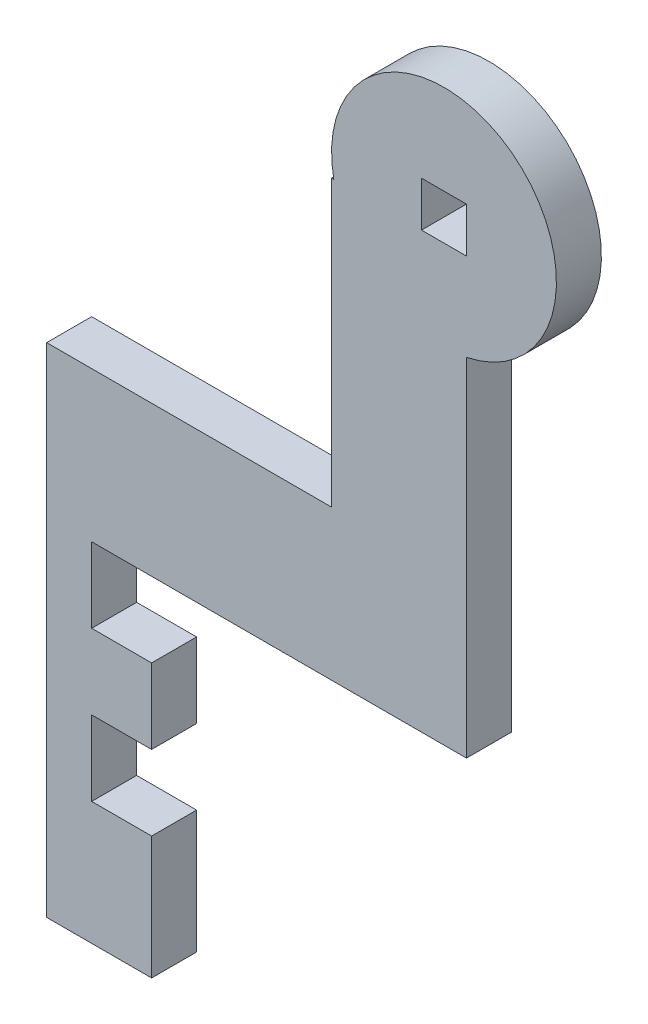
ISO-10303-21;
HEADER;
FILE_DESCRIPTION(('STEP AP214'),'2;1');
FILE_NAME('part.step','',(''),(''),'','','');
FILE_SCHEMA(('AUTOMOTIVE_DESIGN { 1 0 10303 214 1 1 1 1 }'));
ENDSEC;
DATA;
#1=APPLICATION_CONTEXT('core data for automotive mechanical design processes');
#2=APPLICATION_PROTOCOL_DEFINITION('international standard','automotive_design',2000,#1);
#3=PRODUCT_CONTEXT('',#1,'mechanical');
#4=PRODUCT('Part','Part','',(#3));
#5=PRODUCT_RELATED_PRODUCT_CATEGORY('part','',(#4));
#6=PRODUCT_DEFINITION_FORMATION('','',#4);
#7=PRODUCT_DEFINITION_CONTEXT('part definition',#1,'design');
#8=PRODUCT_DEFINITION('design','',#6,#7);
#9=PRODUCT_DEFINITION_SHAPE('','',#8);
#10=(LENGTH_UNIT() NAMED_UNIT(*) SI_UNIT(.MILLI.,.METRE.));
#11=(NAMED_UNIT(*) PLANE_ANGLE_UNIT() SI_UNIT($,.RADIAN.));
#12=(NAMED_UNIT(*) SI_UNIT($,.STERADIAN.) SOLID_ANGLE_UNIT());
#13=UNCERTAINTY_MEASURE_WITH_UNIT(LENGTH_MEASURE(1.E-05),#10,'distance_accuracy_value','');
#14=(GEOMETRIC_REPRESENTATION_CONTEXT(3) GLOBAL_UNCERTAINTY_ASSIGNED_CONTEXT((#13)) GLOBAL_UNIT_ASSIGNED_CONTEXT((#10,
#11,#12)) REPRESENTATION_CONTEXT('',''));
#15=CARTESIAN_POINT('',(0.,0.,0.));
#16=DIRECTION('',(0.,0.,1.));
#17=DIRECTION('',(1.,0.,0.));
#18=AXIS2_PLACEMENT_3D('',#15,#16,#17);
#19=CARTESIAN_POINT('',(-14.,16.6,3.));
#20=DIRECTION('',(0.,-1.,0.));
#21=DIRECTION('',(0.,0.,-1.));
#22=AXIS2_PLACEMENT_3D('',#19,#20,#21);
#23=PLANE('',#22);
#24=DIRECTION('',(0.,0.,1.));
#25=VECTOR('',#24,1.);
#26=CARTESIAN_POINT('',(5.,16.6,0.));
#27=LINE('',#26,#25);
#28=CARTESIAN_POINT('',(5.,16.6,0.));
#29=VERTEX_POINT('',#28);
#30=CARTESIAN_POINT('',(5.,16.6,3.));
#31=VERTEX_POINT('',#30);
#32=EDGE_CURVE('E53',#29,#31,#27,.T.);
#33=ORIENTED_EDGE('',*,*,#32,.F.);
#34=DIRECTION('',(-1.,0.,0.));
#35=VECTOR('',#34,1.);
#36=CARTESIAN_POINT('',(-14.,16.6,0.));
#37=LINE('',#36,#35);
#38=CARTESIAN_POINT('',(-14.,16.6,0.));
#39=VERTEX_POINT('',#38);
#40=EDGE_CURVE('E246',#29,#39,#37,.T.);
#41=ORIENTED_EDGE('',*,*,#40,.T.);
#42=DIRECTION('',(0.,0.,-1.));
#43=VECTOR('',#42,1.);
#44=CARTESIAN_POINT('',(-14.,16.6,3.));
#45=LINE('',#44,#43);
#46=CARTESIAN_POINT('',(-14.,16.6,3.));
#47=VERTEX_POINT('',#46);
#48=EDGE_CURVE('E11',#47,#39,#45,.T.);
#49=ORIENTED_EDGE('',*,*,#48,.F.);
#50=DIRECTION('',(-1.,0.,0.));
#51=VECTOR('',#50,1.);
#52=CARTESIAN_POINT('',(-14.,16.6,3.));
#53=LINE('',#52,#51);
#54=EDGE_CURVE('E230',#31,#47,#53,.T.);
#55=ORIENTED_EDGE('',*,*,#54,.F.);
#56=EDGE_LOOP('',(#33,#41,#49,#55));
#57=FACE_BOUND('',#56,.T.);
#58=ADVANCED_FACE('F36',(#57),#23,.F.);
#59=CARTESIAN_POINT('',(14.,16.6,3.));
#60=DIRECTION('',(-1.,0.,0.));
#61=DIRECTION('',(0.,-1.,0.));
#62=AXIS2_PLACEMENT_3D('',#59,#60,#61);
#63=PLANE('',#62);
#64=DIRECTION('',(0.,1.,0.));
#65=VECTOR('',#64,1.);
#66=CARTESIAN_POINT('',(14.,16.6,3.));
#67=LINE('',#66,#65);
#68=CARTESIAN_POINT('',(14.,6.6,3.));
#69=VERTEX_POINT('',#68);
#70=CARTESIAN_POINT('',(14.,29.7515307716505,3.));
#71=VERTEX_POINT('',#70);
#72=EDGE_CURVE('E261',#69,#71,#67,.T.);
#73=ORIENTED_EDGE('',*,*,#72,.F.);
#74=DIRECTION('',(0.,0.,1.));
#75=VECTOR('',#74,1.);
#76=CARTESIAN_POINT('',(14.,6.6,0.));
#77=LINE('',#76,#75);
#78=CARTESIAN_POINT('',(14.,6.6,0.));
#79=VERTEX_POINT('',#78);
#80=EDGE_CURVE('E253',#79,#69,#77,.T.);
#81=ORIENTED_EDGE('',*,*,#80,.F.);
#82=DIRECTION('',(0.,1.,0.));
#83=VECTOR('',#82,1.);
#84=CARTESIAN_POINT('',(14.,16.6,0.));
#85=LINE('',#84,#83);
#86=CARTESIAN_POINT('',(14.,29.7515307716505,0.));
#87=VERTEX_POINT('',#86);
#88=EDGE_CURVE('E250',#79,#87,#85,.T.);
#89=ORIENTED_EDGE('',*,*,#88,.T.);
#90=DIRECTION('',(0.,0.,1.));
#91=VECTOR('',#90,1.);
#92=CARTESIAN_POINT('',(14.,29.7515307716505,0.));
#93=LINE('',#92,#91);
#94=EDGE_CURVE('E339',#87,#71,#93,.T.);
#95=ORIENTED_EDGE('',*,*,#94,.T.);
#96=EDGE_LOOP('',(#73,#81,#89,#95));
#97=FACE_BOUND('',#96,.T.);
#98=ADVANCED_FACE('F38',(#97),#63,.F.);
#99=CARTESIAN_POINT('',(-14.,16.6,3.));
#100=DIRECTION('',(1.,0.,0.));
#101=DIRECTION('',(0.,1.,0.));
#102=AXIS2_PLACEMENT_3D('',#99,#100,#101);
#103=PLANE('',#102);
#104=DIRECTION('',(0.,-1.,0.));
#105=VECTOR('',#104,1.);
#106=CARTESIAN_POINT('',(-14.,16.6,0.));
#107=LINE('',#106,#105);
#108=CARTESIAN_POINT('',(-14.,-16.6,0.));
#109=VERTEX_POINT('',#108);
#110=EDGE_CURVE('E248',#39,#109,#107,.T.);
#111=ORIENTED_EDGE('',*,*,#110,.T.);
#112=DIRECTION('',(0.,0.,-1.));
#113=VECTOR('',#112,1.);
#114=CARTESIAN_POINT('',(-14.,-16.6,3.));
#115=LINE('',#114,#113);
#116=CARTESIAN_POINT('',(-14.,-16.6,3.));
#117=VERTEX_POINT('',#116);
#118=EDGE_CURVE('E45',#117,#109,#115,.T.);
#119=ORIENTED_EDGE('',*,*,#118,.F.);
#120=DIRECTION('',(0.,-1.,0.));
#121=VECTOR('',#120,1.);
#122=CARTESIAN_POINT('',(-14.,16.6,3.));
#123=LINE('',#122,#121);
#124=EDGE_CURVE('E268',#47,#117,#123,.T.);
#125=ORIENTED_EDGE('',*,*,#124,.F.);
#126=ORIENTED_EDGE('',*,*,#48,.T.);
#127=EDGE_LOOP('',(#111,#119,#125,#126));
#128=FACE_BOUND('',#127,.T.);
#129=ADVANCED_FACE('F385',(#128),#103,.F.);
#130=CARTESIAN_POINT('',(-14.,-16.6,3.));
#131=DIRECTION('',(0.,1.,0.));
#132=DIRECTION('',(-1.,0.,0.));
#133=AXIS2_PLACEMENT_3D('',#130,#131,#132);
#134=PLANE('',#133);
#135=DIRECTION('',(1.,0.,0.));
#136=VECTOR('',#135,1.);
#137=CARTESIAN_POINT('',(-14.,-16.6,0.));
#138=LINE('',#137,#136);
#139=CARTESIAN_POINT('',(-7.,-16.6,0.));
#140=VERTEX_POINT('',#139);
#141=EDGE_CURVE('E251',#109,#140,#138,.T.);
#142=ORIENTED_EDGE('',*,*,#141,.T.);
#143=DIRECTION('',(0.,0.,1.));
#144=VECTOR('',#143,1.);
#145=CARTESIAN_POINT('',(-7.,-16.6,0.));
#146=LINE('',#145,#144);
#147=CARTESIAN_POINT('',(-7.,-16.6,3.));
#148=VERTEX_POINT('',#147);
#149=EDGE_CURVE('E289',#140,#148,#146,.T.);
#150=ORIENTED_EDGE('',*,*,#149,.T.);
#151=DIRECTION('',(1.,0.,0.));
#152=VECTOR('',#151,1.);
#153=CARTESIAN_POINT('',(-14.,-16.6,3.));
#154=LINE('',#153,#152);
#155=EDGE_CURVE('E263',#117,#148,#154,.T.);
#156=ORIENTED_EDGE('',*,*,#155,.F.);
#157=ORIENTED_EDGE('',*,*,#118,.T.);
#158=EDGE_LOOP('',(#142,#150,#156,#157));
#159=FACE_BOUND('',#158,.T.);
#160=ADVANCED_FACE('F383',(#159),#134,.F.);
#161=CARTESIAN_POINT('',(0.,0.,3.));
#162=DIRECTION('',(0.,0.,1.));
#163=DIRECTION('',(1.,0.,0.));
#164=AXIS2_PLACEMENT_3D('',#161,#162,#163);
#165=PLANE('',#164);
#166=DIRECTION('',(-1.,0.,0.));
#167=VECTOR('',#166,1.);
#168=CARTESIAN_POINT('',(0.,6.6,3.));
#169=LINE('',#168,#167);
#170=CARTESIAN_POINT('',(-11.,6.6,3.));
#171=VERTEX_POINT('',#170);
#172=EDGE_CURVE('E229',#69,#171,#169,.T.);
#173=ORIENTED_EDGE('',*,*,#172,.F.);
#174=ORIENTED_EDGE('',*,*,#72,.T.);
#175=CARTESIAN_POINT('',(12.5,37.1,3.));
#176=DIRECTION('',(0.,0.,1.));
#177=DIRECTION('',(1.,0.,0.));
#178=AXIS2_PLACEMENT_3D('',#175,#176,#177);
#179=CIRCLE('',#178,7.5);
#180=CARTESIAN_POINT('',(5.15153077165046,35.6,3.));
#181=VERTEX_POINT('',#180);
#182=EDGE_CURVE('E216',#71,#181,#179,.T.);
#183=ORIENTED_EDGE('',*,*,#182,.T.);
#184=DIRECTION('',(-1.,0.,0.));
#185=VECTOR('',#184,1.);
#186=CARTESIAN_POINT('',(0.,35.6,3.));
#187=LINE('',#186,#185);
#188=CARTESIAN_POINT('',(5.,35.6,3.));
#189=VERTEX_POINT('',#188);
#190=EDGE_CURVE('E219',#181,#189,#187,.T.);
#191=ORIENTED_EDGE('',*,*,#190,.T.);
#192=DIRECTION('',(0.,-1.,0.));
#193=VECTOR('',#192,1.);
#194=CARTESIAN_POINT('',(5.,0.,3.));
#195=LINE('',#194,#193);
#196=EDGE_CURVE('E190',#189,#31,#195,.T.);
#197=ORIENTED_EDGE('',*,*,#196,.T.);
#198=ORIENTED_EDGE('',*,*,#54,.T.);
#199=ORIENTED_EDGE('',*,*,#124,.T.);
#200=ORIENTED_EDGE('',*,*,#155,.T.);
#201=DIRECTION('',(0.,-1.,0.));
#202=VECTOR('',#201,1.);
#203=CARTESIAN_POINT('',(-7.,0.,3.));
#204=LINE('',#203,#202);
#205=CARTESIAN_POINT('',(-7.,-8.4,3.));
#206=VERTEX_POINT('',#205);
#207=EDGE_CURVE('E293',#206,#148,#204,.T.);
#208=ORIENTED_EDGE('',*,*,#207,.F.);
#209=DIRECTION('',(-1.,0.,0.));
#210=VECTOR('',#209,1.);
#211=CARTESIAN_POINT('',(0.,-8.4,3.));
#212=LINE('',#211,#210);
#213=CARTESIAN_POINT('',(-11.,-8.4,3.));
#214=VERTEX_POINT('',#213);
#215=EDGE_CURVE('E296',#206,#214,#212,.T.);
#216=ORIENTED_EDGE('',*,*,#215,.T.);
#217=DIRECTION('',(0.,-1.,0.));
#218=VECTOR('',#217,1.);
#219=CARTESIAN_POINT('',(-11.,0.,3.));
#220=LINE('',#219,#218);
#221=CARTESIAN_POINT('',(-11.,-3.4,3.));
#222=VERTEX_POINT('',#221);
#223=EDGE_CURVE('E299',#222,#214,#220,.T.);
#224=ORIENTED_EDGE('',*,*,#223,.F.);
#225=DIRECTION('',(-1.,0.,0.));
#226=VECTOR('',#225,1.);
#227=CARTESIAN_POINT('',(0.,-3.4,3.));
#228=LINE('',#227,#226);
#229=CARTESIAN_POINT('',(-7.,-3.4,3.));
#230=VERTEX_POINT('',#229);
#231=EDGE_CURVE('E302',#230,#222,#228,.T.);
#232=ORIENTED_EDGE('',*,*,#231,.F.);
#233=DIRECTION('',(0.,-1.,0.));
#234=VECTOR('',#233,1.);
#235=CARTESIAN_POINT('',(-7.,0.,3.));
#236=LINE('',#235,#234);
#237=CARTESIAN_POINT('',(-7.,1.6,3.));
#238=VERTEX_POINT('',#237);
#239=EDGE_CURVE('E305',#238,#230,#236,.T.);
#240=ORIENTED_EDGE('',*,*,#239,.F.);
#241=DIRECTION('',(-1.,0.,0.));
#242=VECTOR('',#241,1.);
#243=CARTESIAN_POINT('',(0.,1.6,3.));
#244=LINE('',#243,#242);
#245=CARTESIAN_POINT('',(-11.,1.6,3.));
#246=VERTEX_POINT('',#245);
#247=EDGE_CURVE('E308',#238,#246,#244,.T.);
#248=ORIENTED_EDGE('',*,*,#247,.T.);
#249=DIRECTION('',(0.,-1.,0.));
#250=VECTOR('',#249,1.);
#251=CARTESIAN_POINT('',(-11.,0.,3.));
#252=LINE('',#251,#250);
#253=EDGE_CURVE('E311',#171,#246,#252,.T.);
#254=ORIENTED_EDGE('',*,*,#253,.F.);
#255=EDGE_LOOP('',(#173,#174,#183,#191,#197,#198,#199,#200,#208,#216,#224,#232,#240,#248,#254));
#256=FACE_BOUND('',#255,.T.);
#257=DIRECTION('',(0.,1.,0.));
#258=VECTOR('',#257,1.);
#259=CARTESIAN_POINT('',(14.,0.,3.));
#260=LINE('',#259,#258);
#261=CARTESIAN_POINT('',(14.,35.6,3.));
#262=VERTEX_POINT('',#261);
#263=CARTESIAN_POINT('',(14.,38.6,3.));
#264=VERTEX_POINT('',#263);
#265=EDGE_CURVE('E207',#262,#264,#260,.T.);
#266=ORIENTED_EDGE('',*,*,#265,.F.);
#267=DIRECTION('',(-1.,0.,0.));
#268=VECTOR('',#267,1.);
#269=CARTESIAN_POINT('',(0.,35.6,3.));
#270=LINE('',#269,#268);
#271=CARTESIAN_POINT('',(11.,35.6,3.));
#272=VERTEX_POINT('',#271);
#273=EDGE_CURVE('E176',#262,#272,#270,.T.);
#274=ORIENTED_EDGE('',*,*,#273,.T.);
#275=DIRECTION('',(0.,1.,0.));
#276=VECTOR('',#275,1.);
#277=CARTESIAN_POINT('',(11.,0.,3.));
#278=LINE('',#277,#276);
#279=CARTESIAN_POINT('',(11.,38.6,3.));
#280=VERTEX_POINT('',#279);
#281=EDGE_CURVE('E210',#272,#280,#278,.T.);
#282=ORIENTED_EDGE('',*,*,#281,.T.);
#283=DIRECTION('',(-1.,0.,0.));
#284=VECTOR('',#283,1.);
#285=CARTESIAN_POINT('',(0.,38.6,3.));
#286=LINE('',#285,#284);
#287=EDGE_CURVE('E213',#264,#280,#286,.T.);
#288=ORIENTED_EDGE('',*,*,#287,.F.);
#289=EDGE_LOOP('',(#266,#274,#282,#288));
#290=FACE_BOUND('',#289,.T.);
#291=ADVANCED_FACE('F348',(#256,#290),#165,.T.);
#292=CARTESIAN_POINT('',(0.,0.,0.));
#293=DIRECTION('',(0.,0.,1.));
#294=DIRECTION('',(1.,0.,0.));
#295=AXIS2_PLACEMENT_3D('',#292,#293,#294);
#296=PLANE('',#295);
#297=ORIENTED_EDGE('',*,*,#88,.F.);
#298=DIRECTION('',(-1.,0.,0.));
#299=VECTOR('',#298,1.);
#300=CARTESIAN_POINT('',(0.,6.6,0.));
#301=LINE('',#300,#299);
#302=CARTESIAN_POINT('',(-11.,6.6,0.));
#303=VERTEX_POINT('',#302);
#304=EDGE_CURVE('E295',#79,#303,#301,.T.);
#305=ORIENTED_EDGE('',*,*,#304,.T.);
#306=DIRECTION('',(0.,-1.,0.));
#307=VECTOR('',#306,1.);
#308=CARTESIAN_POINT('',(-11.,0.,0.));
#309=LINE('',#308,#307);
#310=CARTESIAN_POINT('',(-11.,1.6,0.));
#311=VERTEX_POINT('',#310);
#312=EDGE_CURVE('E330',#303,#311,#309,.T.);
#313=ORIENTED_EDGE('',*,*,#312,.T.);
#314=DIRECTION('',(-1.,0.,0.));
#315=VECTOR('',#314,1.);
#316=CARTESIAN_POINT('',(0.,1.6,0.));
#317=LINE('',#316,#315);
#318=CARTESIAN_POINT('',(-7.,1.6,0.));
#319=VERTEX_POINT('',#318);
#320=EDGE_CURVE('E328',#319,#311,#317,.T.);
#321=ORIENTED_EDGE('',*,*,#320,.F.);
#322=DIRECTION('',(0.,-1.,0.));
#323=VECTOR('',#322,1.);
#324=CARTESIAN_POINT('',(-7.,0.,0.));
#325=LINE('',#324,#323);
#326=CARTESIAN_POINT('',(-7.,-3.4,0.));
#327=VERTEX_POINT('',#326);
#328=EDGE_CURVE('E325',#319,#327,#325,.T.);
#329=ORIENTED_EDGE('',*,*,#328,.T.);
#330=DIRECTION('',(-1.,0.,0.));
#331=VECTOR('',#330,1.);
#332=CARTESIAN_POINT('',(0.,-3.4,0.));
#333=LINE('',#332,#331);
#334=CARTESIAN_POINT('',(-11.,-3.4,0.));
#335=VERTEX_POINT('',#334);
#336=EDGE_CURVE('E322',#327,#335,#333,.T.);
#337=ORIENTED_EDGE('',*,*,#336,.T.);
#338=DIRECTION('',(0.,-1.,0.));
#339=VECTOR('',#338,1.);
#340=CARTESIAN_POINT('',(-11.,0.,0.));
#341=LINE('',#340,#339);
#342=CARTESIAN_POINT('',(-11.,-8.4,0.));
#343=VERTEX_POINT('',#342);
#344=EDGE_CURVE('E319',#335,#343,#341,.T.);
#345=ORIENTED_EDGE('',*,*,#344,.T.);
#346=DIRECTION('',(-1.,0.,0.));
#347=VECTOR('',#346,1.);
#348=CARTESIAN_POINT('',(0.,-8.4,0.));
#349=LINE('',#348,#347);
#350=CARTESIAN_POINT('',(-7.,-8.4,0.));
#351=VERTEX_POINT('',#350);
#352=EDGE_CURVE('E317',#351,#343,#349,.T.);
#353=ORIENTED_EDGE('',*,*,#352,.F.);
#354=DIRECTION('',(0.,-1.,0.));
#355=VECTOR('',#354,1.);
#356=CARTESIAN_POINT('',(-7.,0.,0.));
#357=LINE('',#356,#355);
#358=EDGE_CURVE('E277',#351,#140,#357,.T.);
#359=ORIENTED_EDGE('',*,*,#358,.T.);
#360=ORIENTED_EDGE('',*,*,#141,.F.);
#361=ORIENTED_EDGE('',*,*,#110,.F.);
#362=ORIENTED_EDGE('',*,*,#40,.F.);
#363=DIRECTION('',(0.,-1.,0.));
#364=VECTOR('',#363,1.);
#365=CARTESIAN_POINT('',(5.,0.,0.));
#366=LINE('',#365,#364);
#367=CARTESIAN_POINT('',(5.,35.6,0.));
#368=VERTEX_POINT('',#367);
#369=EDGE_CURVE('E181',#368,#29,#366,.T.);
#370=ORIENTED_EDGE('',*,*,#369,.F.);
#371=DIRECTION('',(-1.,0.,0.));
#372=VECTOR('',#371,1.);
#373=CARTESIAN_POINT('',(0.,35.6,0.));
#374=LINE('',#373,#372);
#375=CARTESIAN_POINT('',(5.15153077165046,35.6,0.));
#376=VERTEX_POINT('',#375);
#377=EDGE_CURVE('E204',#376,#368,#374,.T.);
#378=ORIENTED_EDGE('',*,*,#377,.F.);
#379=CARTESIAN_POINT('',(12.5,37.1,0.));
#380=DIRECTION('',(0.,0.,1.));
#381=DIRECTION('',(1.,0.,0.));
#382=AXIS2_PLACEMENT_3D('',#379,#380,#381);
#383=CIRCLE('',#382,7.5);
#384=EDGE_CURVE('E201',#87,#376,#383,.T.);
#385=ORIENTED_EDGE('',*,*,#384,.F.);
#386=EDGE_LOOP('',(#297,#305,#313,#321,#329,#337,#345,#353,#359,#360,#361,#362,#370,#378,#385));
#387=FACE_BOUND('',#386,.T.);
#388=DIRECTION('',(0.,1.,0.));
#389=VECTOR('',#388,1.);
#390=CARTESIAN_POINT('',(14.,0.,0.));
#391=LINE('',#390,#389);
#392=CARTESIAN_POINT('',(14.,35.6,0.));
#393=VERTEX_POINT('',#392);
#394=CARTESIAN_POINT('',(14.,38.6,0.));
#395=VERTEX_POINT('',#394);
#396=EDGE_CURVE('E185',#393,#395,#391,.T.);
#397=ORIENTED_EDGE('',*,*,#396,.T.);
#398=DIRECTION('',(-1.,0.,0.));
#399=VECTOR('',#398,1.);
#400=CARTESIAN_POINT('',(0.,38.6,0.));
#401=LINE('',#400,#399);
#402=CARTESIAN_POINT('',(11.,38.6,0.));
#403=VERTEX_POINT('',#402);
#404=EDGE_CURVE('E197',#395,#403,#401,.T.);
#405=ORIENTED_EDGE('',*,*,#404,.T.);
#406=DIRECTION('',(0.,1.,0.));
#407=VECTOR('',#406,1.);
#408=CARTESIAN_POINT('',(11.,0.,0.));
#409=LINE('',#408,#407);
#410=CARTESIAN_POINT('',(11.,35.6,0.));
#411=VERTEX_POINT('',#410);
#412=EDGE_CURVE('E195',#411,#403,#409,.T.);
#413=ORIENTED_EDGE('',*,*,#412,.F.);
#414=DIRECTION('',(-1.,0.,0.));
#415=VECTOR('',#414,1.);
#416=CARTESIAN_POINT('',(0.,35.6,0.));
#417=LINE('',#416,#415);
#418=EDGE_CURVE('E174',#393,#411,#417,.T.);
#419=ORIENTED_EDGE('',*,*,#418,.F.);
#420=EDGE_LOOP('',(#397,#405,#413,#419));
#421=FACE_BOUND('',#420,.T.);
#422=ADVANCED_FACE('F193',(#387,#421),#296,.F.);
#423=CARTESIAN_POINT('',(0.,6.6,0.));
#424=DIRECTION('',(0.,1.,0.));
#425=DIRECTION('',(0.,0.,1.));
#426=AXIS2_PLACEMENT_3D('',#423,#424,#425);
#427=PLANE('',#426);
#428=ORIENTED_EDGE('',*,*,#172,.T.);
#429=DIRECTION('',(0.,0.,1.));
#430=VECTOR('',#429,1.);
#431=CARTESIAN_POINT('',(-11.,6.6,0.));
#432=LINE('',#431,#430);
#433=EDGE_CURVE('E275',#303,#171,#432,.T.);
#434=ORIENTED_EDGE('',*,*,#433,.F.);
#435=ORIENTED_EDGE('',*,*,#304,.F.);
#436=ORIENTED_EDGE('',*,*,#80,.T.);
#437=EDGE_LOOP('',(#428,#434,#435,#436));
#438=FACE_BOUND('',#437,.T.);
#439=ADVANCED_FACE('F356',(#438),#427,.F.);
#440=CARTESIAN_POINT('',(-7.,0.,0.));
#441=DIRECTION('',(-1.,0.,0.));
#442=DIRECTION('',(0.,0.,1.));
#443=AXIS2_PLACEMENT_3D('',#440,#441,#442);
#444=PLANE('',#443);
#445=ORIENTED_EDGE('',*,*,#207,.T.);
#446=ORIENTED_EDGE('',*,*,#149,.F.);
#447=ORIENTED_EDGE('',*,*,#358,.F.);
#448=DIRECTION('',(0.,0.,1.));
#449=VECTOR('',#448,1.);
#450=CARTESIAN_POINT('',(-7.,-8.4,0.));
#451=LINE('',#450,#449);
#452=EDGE_CURVE('E287',#351,#206,#451,.T.);
#453=ORIENTED_EDGE('',*,*,#452,.T.);
#454=EDGE_LOOP('',(#445,#446,#447,#453));
#455=FACE_BOUND('',#454,.T.);
#456=ADVANCED_FACE('F382',(#455),#444,.F.);
#457=CARTESIAN_POINT('',(0.,-8.4,0.));
#458=DIRECTION('',(0.,1.,0.));
#459=DIRECTION('',(0.,0.,1.));
#460=AXIS2_PLACEMENT_3D('',#457,#458,#459);
#461=PLANE('',#460);
#462=ORIENTED_EDGE('',*,*,#215,.F.);
#463=ORIENTED_EDGE('',*,*,#452,.F.);
#464=ORIENTED_EDGE('',*,*,#352,.T.);
#465=DIRECTION('',(0.,0.,1.));
#466=VECTOR('',#465,1.);
#467=CARTESIAN_POINT('',(-11.,-8.4,0.));
#468=LINE('',#467,#466);
#469=EDGE_CURVE('E285',#343,#214,#468,.T.);
#470=ORIENTED_EDGE('',*,*,#469,.T.);
#471=EDGE_LOOP('',(#462,#463,#464,#470));
#472=FACE_BOUND('',#471,.T.);
#473=ADVANCED_FACE('F379',(#472),#461,.T.);
#474=CARTESIAN_POINT('',(-11.,0.,0.));
#475=DIRECTION('',(-1.,0.,0.));
#476=DIRECTION('',(0.,0.,1.));
#477=AXIS2_PLACEMENT_3D('',#474,#475,#476);
#478=PLANE('',#477);
#479=ORIENTED_EDGE('',*,*,#223,.T.);
#480=ORIENTED_EDGE('',*,*,#469,.F.);
#481=ORIENTED_EDGE('',*,*,#344,.F.);
#482=DIRECTION('',(0.,0.,1.));
#483=VECTOR('',#482,1.);
#484=CARTESIAN_POINT('',(-11.,-3.4,0.));
#485=LINE('',#484,#483);
#486=EDGE_CURVE('E283',#335,#222,#485,.T.);
#487=ORIENTED_EDGE('',*,*,#486,.T.);
#488=EDGE_LOOP('',(#479,#480,#481,#487));
#489=FACE_BOUND('',#488,.T.);
#490=ADVANCED_FACE('F375',(#489),#478,.F.);
#491=CARTESIAN_POINT('',(0.,-3.4,0.));
#492=DIRECTION('',(0.,1.,0.));
#493=DIRECTION('',(0.,0.,1.));
#494=AXIS2_PLACEMENT_3D('',#491,#492,#493);
#495=PLANE('',#494);
#496=ORIENTED_EDGE('',*,*,#231,.T.);
#497=ORIENTED_EDGE('',*,*,#486,.F.);
#498=ORIENTED_EDGE('',*,*,#336,.F.);
#499=DIRECTION('',(0.,0.,1.));
#500=VECTOR('',#499,1.);
#501=CARTESIAN_POINT('',(-7.,-3.4,0.));
#502=LINE('',#501,#500);
#503=EDGE_CURVE('E281',#327,#230,#502,.T.);
#504=ORIENTED_EDGE('',*,*,#503,.T.);
#505=EDGE_LOOP('',(#496,#497,#498,#504));
#506=FACE_BOUND('',#505,.T.);
#507=ADVANCED_FACE('F370',(#506),#495,.F.);
#508=CARTESIAN_POINT('',(-7.,0.,0.));
#509=DIRECTION('',(-1.,0.,0.));
#510=DIRECTION('',(0.,0.,1.));
#511=AXIS2_PLACEMENT_3D('',#508,#509,#510);
#512=PLANE('',#511);
#513=ORIENTED_EDGE('',*,*,#239,.T.);
#514=ORIENTED_EDGE('',*,*,#503,.F.);
#515=ORIENTED_EDGE('',*,*,#328,.F.);
#516=DIRECTION('',(0.,0.,1.));
#517=VECTOR('',#516,1.);
#518=CARTESIAN_POINT('',(-7.,1.6,0.));
#519=LINE('',#518,#517);
#520=EDGE_CURVE('E279',#319,#238,#519,.T.);
#521=ORIENTED_EDGE('',*,*,#520,.T.);
#522=EDGE_LOOP('',(#513,#514,#515,#521));
#523=FACE_BOUND('',#522,.T.);
#524=ADVANCED_FACE('F366',(#523),#512,.F.);
#525=CARTESIAN_POINT('',(0.,1.6,0.));
#526=DIRECTION('',(0.,1.,0.));
#527=DIRECTION('',(0.,0.,1.));
#528=AXIS2_PLACEMENT_3D('',#525,#526,#527);
#529=PLANE('',#528);
#530=ORIENTED_EDGE('',*,*,#247,.F.);
#531=ORIENTED_EDGE('',*,*,#520,.F.);
#532=ORIENTED_EDGE('',*,*,#320,.T.);
#533=DIRECTION('',(0.,0.,1.));
#534=VECTOR('',#533,1.);
#535=CARTESIAN_POINT('',(-11.,1.6,0.));
#536=LINE('',#535,#534);
#537=EDGE_CURVE('E61',#311,#246,#536,.T.);
#538=ORIENTED_EDGE('',*,*,#537,.T.);
#539=EDGE_LOOP('',(#530,#531,#532,#538));
#540=FACE_BOUND('',#539,.T.);
#541=ADVANCED_FACE('F364',(#540),#529,.T.);
#542=CARTESIAN_POINT('',(-11.,0.,0.));
#543=DIRECTION('',(-1.,0.,0.));
#544=DIRECTION('',(0.,0.,1.));
#545=AXIS2_PLACEMENT_3D('',#542,#543,#544);
#546=PLANE('',#545);
#547=ORIENTED_EDGE('',*,*,#253,.T.);
#548=ORIENTED_EDGE('',*,*,#537,.F.);
#549=ORIENTED_EDGE('',*,*,#312,.F.);
#550=ORIENTED_EDGE('',*,*,#433,.T.);
#551=EDGE_LOOP('',(#547,#548,#549,#550));
#552=FACE_BOUND('',#551,.T.);
#553=ADVANCED_FACE('F360',(#552),#546,.F.);
#554=CARTESIAN_POINT('',(5.,0.,0.));
#555=DIRECTION('',(-1.,0.,0.));
#556=DIRECTION('',(0.,0.,1.));
#557=AXIS2_PLACEMENT_3D('',#554,#555,#556);
#558=PLANE('',#557);
#559=ORIENTED_EDGE('',*,*,#196,.F.);
#560=DIRECTION('',(0.,0.,1.));
#561=VECTOR('',#560,1.);
#562=CARTESIAN_POINT('',(5.,35.6,0.));
#563=LINE('',#562,#561);
#564=EDGE_CURVE('E224',#368,#189,#563,.T.);
#565=ORIENTED_EDGE('',*,*,#564,.F.);
#566=ORIENTED_EDGE('',*,*,#369,.T.);
#567=ORIENTED_EDGE('',*,*,#32,.T.);
#568=EDGE_LOOP('',(#559,#565,#566,#567));
#569=FACE_BOUND('',#568,.T.);
#570=ADVANCED_FACE('F240',(#569),#558,.T.);
#571=CARTESIAN_POINT('',(0.,35.6,0.));
#572=DIRECTION('',(0.,1.,0.));
#573=DIRECTION('',(0.,0.,1.));
#574=AXIS2_PLACEMENT_3D('',#571,#572,#573);
#575=PLANE('',#574);
#576=ORIENTED_EDGE('',*,*,#190,.F.);
#577=DIRECTION('',(0.,0.,1.));
#578=VECTOR('',#577,1.);
#579=CARTESIAN_POINT('',(5.15153077165046,35.6,0.));
#580=LINE('',#579,#578);
#581=EDGE_CURVE('E341',#376,#181,#580,.T.);
#582=ORIENTED_EDGE('',*,*,#581,.F.);
#583=ORIENTED_EDGE('',*,*,#377,.T.);
#584=ORIENTED_EDGE('',*,*,#564,.T.);
#585=EDGE_LOOP('',(#576,#582,#583,#584));
#586=FACE_BOUND('',#585,.T.);
#587=ADVANCED_FACE('F346',(#586),#575,.T.);
#588=CARTESIAN_POINT('',(12.5,37.1,0.));
#589=DIRECTION('',(0.,0.,1.));
#590=DIRECTION('',(1.,0.,0.));
#591=AXIS2_PLACEMENT_3D('',#588,#589,#590);
#592=CYLINDRICAL_SURFACE('',#591,7.5);
#593=ORIENTED_EDGE('',*,*,#182,.F.);
#594=ORIENTED_EDGE('',*,*,#94,.F.);
#595=ORIENTED_EDGE('',*,*,#384,.T.);
#596=ORIENTED_EDGE('',*,*,#581,.T.);
#597=EDGE_LOOP('',(#593,#594,#595,#596));
#598=FACE_BOUND('',#597,.T.);
#599=ADVANCED_FACE('F352',(#598),#592,.T.);
#600=CARTESIAN_POINT('',(14.,0.,0.));
#601=DIRECTION('',(1.,0.,0.));
#602=DIRECTION('',(0.,0.,-1.));
#603=AXIS2_PLACEMENT_3D('',#600,#601,#602);
#604=PLANE('',#603);
#605=ORIENTED_EDGE('',*,*,#265,.T.);
#606=DIRECTION('',(0.,0.,1.));
#607=VECTOR('',#606,1.);
#608=CARTESIAN_POINT('',(14.,38.6,0.));
#609=LINE('',#608,#607);
#610=EDGE_CURVE('E188',#395,#264,#609,.T.);
#611=ORIENTED_EDGE('',*,*,#610,.F.);
#612=ORIENTED_EDGE('',*,*,#396,.F.);
#613=DIRECTION('',(0.,0.,1.));
#614=VECTOR('',#613,1.);
#615=CARTESIAN_POINT('',(14.,35.6,0.));
#616=LINE('',#615,#614);
#617=EDGE_CURVE('E170',#393,#262,#616,.T.);
#618=ORIENTED_EDGE('',*,*,#617,.T.);
#619=EDGE_LOOP('',(#605,#611,#612,#618));
#620=FACE_BOUND('',#619,.T.);
#621=ADVANCED_FACE('F186',(#620),#604,.F.);
#622=CARTESIAN_POINT('',(0.,38.6,0.));
#623=DIRECTION('',(0.,1.,0.));
#624=DIRECTION('',(0.,0.,1.));
#625=AXIS2_PLACEMENT_3D('',#622,#623,#624);
#626=PLANE('',#625);
#627=ORIENTED_EDGE('',*,*,#287,.T.);
#628=DIRECTION('',(0.,0.,1.));
#629=VECTOR('',#628,1.);
#630=CARTESIAN_POINT('',(11.,38.6,0.));
#631=LINE('',#630,#629);
#632=EDGE_CURVE('E336',#403,#280,#631,.T.);
#633=ORIENTED_EDGE('',*,*,#632,.F.);
#634=ORIENTED_EDGE('',*,*,#404,.F.);
#635=ORIENTED_EDGE('',*,*,#610,.T.);
#636=EDGE_LOOP('',(#627,#633,#634,#635));
#637=FACE_BOUND('',#636,.T.);
#638=ADVANCED_FACE('F552',(#637),#626,.F.);
#639=CARTESIAN_POINT('',(11.,0.,0.));
#640=DIRECTION('',(1.,0.,0.));
#641=DIRECTION('',(0.,0.,-1.));
#642=AXIS2_PLACEMENT_3D('',#639,#640,#641);
#643=PLANE('',#642);
#644=ORIENTED_EDGE('',*,*,#281,.F.);
#645=DIRECTION('',(0.,0.,1.));
#646=VECTOR('',#645,1.);
#647=CARTESIAN_POINT('',(11.,35.6,0.));
#648=LINE('',#647,#646);
#649=EDGE_CURVE('E180',#411,#272,#648,.T.);
#650=ORIENTED_EDGE('',*,*,#649,.F.);
#651=ORIENTED_EDGE('',*,*,#412,.T.);
#652=ORIENTED_EDGE('',*,*,#632,.T.);
#653=EDGE_LOOP('',(#644,#650,#651,#652));
#654=FACE_BOUND('',#653,.T.);
#655=ADVANCED_FACE('F563',(#654),#643,.T.);
#656=CARTESIAN_POINT('',(0.,35.6,0.));
#657=DIRECTION('',(0.,1.,0.));
#658=DIRECTION('',(0.,0.,1.));
#659=AXIS2_PLACEMENT_3D('',#656,#657,#658);
#660=PLANE('',#659);
#661=ORIENTED_EDGE('',*,*,#273,.F.);
#662=ORIENTED_EDGE('',*,*,#617,.F.);
#663=ORIENTED_EDGE('',*,*,#418,.T.);
#664=ORIENTED_EDGE('',*,*,#649,.T.);
#665=EDGE_LOOP('',(#661,#662,#663,#664));
#666=FACE_BOUND('',#665,.T.);
#667=ADVANCED_FACE('F172',(#666),#660,.T.);
#668=CLOSED_SHELL('',(#58,#98,#129,#160,#291,#422,#439,#456,#473,#490,#507,#524,#541,#553,#570,
#587,#599,#621,#638,#655,#667));
#669=MANIFOLD_SOLID_BREP('B2',#668);
#670=ADVANCED_BREP_SHAPE_REPRESENTATION('',(#18,#669),#14);
#671=SHAPE_DEFINITION_REPRESENTATION(#9,#670);
ENDSEC;
END-ISO-10303-21;
